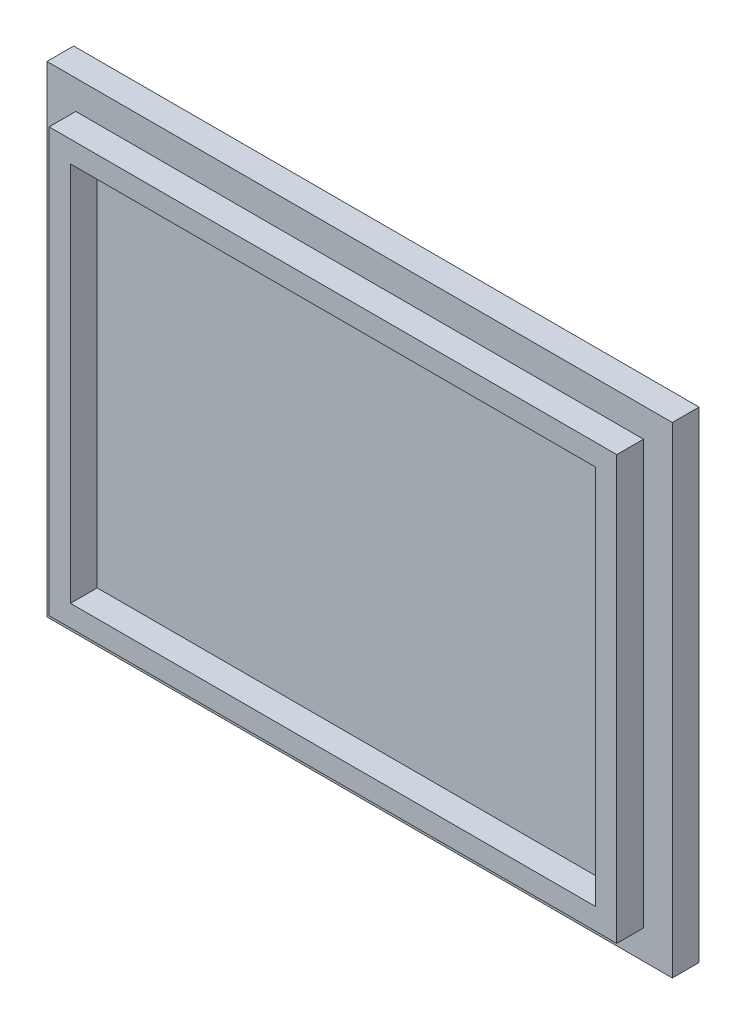
ISO-10303-21;
HEADER;
FILE_DESCRIPTION(('STEP AP214'),'2;1');
FILE_NAME('part.step','',(''),(''),'','','');
FILE_SCHEMA(('AUTOMOTIVE_DESIGN { 1 0 10303 214 1 1 1 1 }'));
ENDSEC;
DATA;
#1=APPLICATION_CONTEXT('core data for automotive mechanical design processes');
#2=APPLICATION_PROTOCOL_DEFINITION('international standard','automotive_design',2000,#1);
#3=PRODUCT_CONTEXT('',#1,'mechanical');
#4=PRODUCT('Part','Part','',(#3));
#5=PRODUCT_RELATED_PRODUCT_CATEGORY('part','',(#4));
#6=PRODUCT_DEFINITION_FORMATION('','',#4);
#7=PRODUCT_DEFINITION_CONTEXT('part definition',#1,'design');
#8=PRODUCT_DEFINITION('design','',#6,#7);
#9=PRODUCT_DEFINITION_SHAPE('','',#8);
#10=(LENGTH_UNIT() NAMED_UNIT(*) SI_UNIT(.MILLI.,.METRE.));
#11=(NAMED_UNIT(*) PLANE_ANGLE_UNIT() SI_UNIT($,.RADIAN.));
#12=(NAMED_UNIT(*) SI_UNIT($,.STERADIAN.) SOLID_ANGLE_UNIT());
#13=UNCERTAINTY_MEASURE_WITH_UNIT(LENGTH_MEASURE(1.E-05),#10,'distance_accuracy_value','');
#14=(GEOMETRIC_REPRESENTATION_CONTEXT(3) GLOBAL_UNCERTAINTY_ASSIGNED_CONTEXT((#13)) GLOBAL_UNIT_ASSIGNED_CONTEXT((#10,
#11,#12)) REPRESENTATION_CONTEXT('',''));
#15=CARTESIAN_POINT('',(0.,0.,0.));
#16=DIRECTION('',(0.,0.,1.));
#17=DIRECTION('',(1.,0.,0.));
#18=AXIS2_PLACEMENT_3D('',#15,#16,#17);
#19=CARTESIAN_POINT('',(0.,0.,6.35));
#20=DIRECTION('',(0.,0.,-1.));
#21=DIRECTION('',(-1.,0.,0.));
#22=AXIS2_PLACEMENT_3D('',#19,#20,#21);
#23=PLANE('',#22);
#24=DIRECTION('',(0.,1.,0.));
#25=VECTOR('',#24,1.);
#26=CARTESIAN_POINT('',(-67.437,-50.292,6.35));
#27=LINE('',#26,#25);
#28=CARTESIAN_POINT('',(-67.437,-50.292,6.35));
#29=VERTEX_POINT('',#28);
#30=CARTESIAN_POINT('',(-67.437,50.292,6.35));
#31=VERTEX_POINT('',#30);
#32=EDGE_CURVE('E72',#29,#31,#27,.T.);
#33=ORIENTED_EDGE('',*,*,#32,.T.);
#34=DIRECTION('',(1.,0.,0.));
#35=VECTOR('',#34,1.);
#36=CARTESIAN_POINT('',(-67.437,50.292,6.35));
#37=LINE('',#36,#35);
#38=CARTESIAN_POINT('',(67.437,50.292,6.35));
#39=VERTEX_POINT('',#38);
#40=EDGE_CURVE('E165',#31,#39,#37,.T.);
#41=ORIENTED_EDGE('',*,*,#40,.T.);
#42=DIRECTION('',(0.,1.,0.));
#43=VECTOR('',#42,1.);
#44=CARTESIAN_POINT('',(67.437,-50.292,6.35));
#45=LINE('',#44,#43);
#46=CARTESIAN_POINT('',(67.437,-50.292,6.35));
#47=VERTEX_POINT('',#46);
#48=EDGE_CURVE('E201',#47,#39,#45,.T.);
#49=ORIENTED_EDGE('',*,*,#48,.F.);
#50=DIRECTION('',(1.,0.,0.));
#51=VECTOR('',#50,1.);
#52=CARTESIAN_POINT('',(-67.437,-50.292,6.35));
#53=LINE('',#52,#51);
#54=EDGE_CURVE('E77',#29,#47,#53,.T.);
#55=ORIENTED_EDGE('',*,*,#54,.F.);
#56=EDGE_LOOP('',(#33,#41,#49,#55));
#57=FACE_BOUND('',#56,.T.);
#58=DIRECTION('',(0.,1.,0.));
#59=VECTOR('',#58,1.);
#60=CARTESIAN_POINT('',(74.295,-57.15,6.35));
#61=LINE('',#60,#59);
#62=CARTESIAN_POINT('',(74.295,-57.15,6.35));
#63=VERTEX_POINT('',#62);
#64=CARTESIAN_POINT('',(74.295,57.15,6.35));
#65=VERTEX_POINT('',#64);
#66=EDGE_CURVE('E216',#63,#65,#61,.T.);
#67=ORIENTED_EDGE('',*,*,#66,.T.);
#68=DIRECTION('',(-1.,0.,0.));
#69=VECTOR('',#68,1.);
#70=CARTESIAN_POINT('',(-74.295,57.15,6.35));
#71=LINE('',#70,#69);
#72=CARTESIAN_POINT('',(-74.295,57.15,6.35));
#73=VERTEX_POINT('',#72);
#74=EDGE_CURVE('E219',#65,#73,#71,.T.);
#75=ORIENTED_EDGE('',*,*,#74,.T.);
#76=DIRECTION('',(0.,-1.,0.));
#77=VECTOR('',#76,1.);
#78=CARTESIAN_POINT('',(-74.295,-57.15,6.35));
#79=LINE('',#78,#77);
#80=CARTESIAN_POINT('',(-74.295,-57.15,6.35));
#81=VERTEX_POINT('',#80);
#82=EDGE_CURVE('E222',#73,#81,#79,.T.);
#83=ORIENTED_EDGE('',*,*,#82,.T.);
#84=DIRECTION('',(1.,0.,0.));
#85=VECTOR('',#84,1.);
#86=CARTESIAN_POINT('',(-74.295,-57.15,6.35));
#87=LINE('',#86,#85);
#88=EDGE_CURVE('E224',#81,#63,#87,.T.);
#89=ORIENTED_EDGE('',*,*,#88,.T.);
#90=EDGE_LOOP('',(#67,#75,#83,#89));
#91=FACE_BOUND('',#90,.T.);
#92=ADVANCED_FACE('F57',(#57,#91),#23,.F.);
#93=CARTESIAN_POINT('',(74.295,-57.15,6.35));
#94=DIRECTION('',(-1.,0.,0.));
#95=DIRECTION('',(0.,0.,1.));
#96=AXIS2_PLACEMENT_3D('',#93,#94,#95);
#97=PLANE('',#96);
#98=DIRECTION('',(0.,1.,0.));
#99=VECTOR('',#98,1.);
#100=CARTESIAN_POINT('',(74.295,-57.15,0.));
#101=LINE('',#100,#99);
#102=CARTESIAN_POINT('',(74.295,-57.15,0.));
#103=VERTEX_POINT('',#102);
#104=CARTESIAN_POINT('',(74.295,57.15,0.));
#105=VERTEX_POINT('',#104);
#106=EDGE_CURVE('E208',#103,#105,#101,.T.);
#107=ORIENTED_EDGE('',*,*,#106,.T.);
#108=DIRECTION('',(0.,0.,-1.));
#109=VECTOR('',#108,1.);
#110=CARTESIAN_POINT('',(74.295,57.15,6.35));
#111=LINE('',#110,#109);
#112=EDGE_CURVE('E12',#65,#105,#111,.T.);
#113=ORIENTED_EDGE('',*,*,#112,.F.);
#114=ORIENTED_EDGE('',*,*,#66,.F.);
#115=DIRECTION('',(0.,0.,-1.));
#116=VECTOR('',#115,1.);
#117=CARTESIAN_POINT('',(74.295,-57.15,6.35));
#118=LINE('',#117,#116);
#119=EDGE_CURVE('E226',#63,#103,#118,.T.);
#120=ORIENTED_EDGE('',*,*,#119,.T.);
#121=EDGE_LOOP('',(#107,#113,#114,#120));
#122=FACE_BOUND('',#121,.T.);
#123=ADVANCED_FACE('F59',(#122),#97,.F.);
#124=CARTESIAN_POINT('',(-74.295,57.15,6.35));
#125=DIRECTION('',(0.,-1.,0.));
#126=DIRECTION('',(0.,0.,-1.));
#127=AXIS2_PLACEMENT_3D('',#124,#125,#126);
#128=PLANE('',#127);
#129=DIRECTION('',(-1.,0.,0.));
#130=VECTOR('',#129,1.);
#131=CARTESIAN_POINT('',(-74.295,57.15,0.));
#132=LINE('',#131,#130);
#133=CARTESIAN_POINT('',(-74.295,57.15,0.));
#134=VERTEX_POINT('',#133);
#135=EDGE_CURVE('E229',#105,#134,#132,.T.);
#136=ORIENTED_EDGE('',*,*,#135,.T.);
#137=DIRECTION('',(0.,0.,-1.));
#138=VECTOR('',#137,1.);
#139=CARTESIAN_POINT('',(-74.295,57.15,6.35));
#140=LINE('',#139,#138);
#141=EDGE_CURVE('E65',#73,#134,#140,.T.);
#142=ORIENTED_EDGE('',*,*,#141,.F.);
#143=ORIENTED_EDGE('',*,*,#74,.F.);
#144=ORIENTED_EDGE('',*,*,#112,.T.);
#145=EDGE_LOOP('',(#136,#142,#143,#144));
#146=FACE_BOUND('',#145,.T.);
#147=ADVANCED_FACE('F258',(#146),#128,.F.);
#148=CARTESIAN_POINT('',(-74.295,-57.15,6.35));
#149=DIRECTION('',(1.,0.,0.));
#150=DIRECTION('',(0.,0.,-1.));
#151=AXIS2_PLACEMENT_3D('',#148,#149,#150);
#152=PLANE('',#151);
#153=DIRECTION('',(0.,-1.,0.));
#154=VECTOR('',#153,1.);
#155=CARTESIAN_POINT('',(-74.295,-57.15,0.));
#156=LINE('',#155,#154);
#157=CARTESIAN_POINT('',(-74.295,-57.15,0.));
#158=VERTEX_POINT('',#157);
#159=EDGE_CURVE('E231',#134,#158,#156,.T.);
#160=ORIENTED_EDGE('',*,*,#159,.T.);
#161=DIRECTION('',(0.,0.,-1.));
#162=VECTOR('',#161,1.);
#163=CARTESIAN_POINT('',(-74.295,-57.15,6.35));
#164=LINE('',#163,#162);
#165=EDGE_CURVE('E236',#81,#158,#164,.T.);
#166=ORIENTED_EDGE('',*,*,#165,.F.);
#167=ORIENTED_EDGE('',*,*,#82,.F.);
#168=ORIENTED_EDGE('',*,*,#141,.T.);
#169=EDGE_LOOP('',(#160,#166,#167,#168));
#170=FACE_BOUND('',#169,.T.);
#171=ADVANCED_FACE('F243',(#170),#152,.F.);
#172=CARTESIAN_POINT('',(-74.295,-57.15,6.35));
#173=DIRECTION('',(0.,1.,0.));
#174=DIRECTION('',(0.,0.,1.));
#175=AXIS2_PLACEMENT_3D('',#172,#173,#174);
#176=PLANE('',#175);
#177=DIRECTION('',(1.,0.,0.));
#178=VECTOR('',#177,1.);
#179=CARTESIAN_POINT('',(-74.295,-57.15,0.));
#180=LINE('',#179,#178);
#181=EDGE_CURVE('E220',#158,#103,#180,.T.);
#182=ORIENTED_EDGE('',*,*,#181,.T.);
#183=ORIENTED_EDGE('',*,*,#119,.F.);
#184=ORIENTED_EDGE('',*,*,#88,.F.);
#185=ORIENTED_EDGE('',*,*,#165,.T.);
#186=EDGE_LOOP('',(#182,#183,#184,#185));
#187=FACE_BOUND('',#186,.T.);
#188=ADVANCED_FACE('F252',(#187),#176,.F.);
#189=CARTESIAN_POINT('',(0.,0.,0.));
#190=DIRECTION('',(0.,0.,-1.));
#191=DIRECTION('',(-1.,0.,0.));
#192=AXIS2_PLACEMENT_3D('',#189,#190,#191);
#193=PLANE('',#192);
#194=ORIENTED_EDGE('',*,*,#106,.F.);
#195=ORIENTED_EDGE('',*,*,#181,.F.);
#196=ORIENTED_EDGE('',*,*,#159,.F.);
#197=ORIENTED_EDGE('',*,*,#135,.F.);
#198=EDGE_LOOP('',(#194,#195,#196,#197));
#199=FACE_BOUND('',#198,.T.);
#200=ADVANCED_FACE('F249',(#199),#193,.T.);
#201=CARTESIAN_POINT('',(0.,0.,12.7));
#202=DIRECTION('',(0.,0.,1.));
#203=DIRECTION('',(1.,0.,0.));
#204=AXIS2_PLACEMENT_3D('',#201,#202,#203);
#205=PLANE('',#204);
#206=DIRECTION('',(1.,0.,0.));
#207=VECTOR('',#206,1.);
#208=CARTESIAN_POINT('',(-67.437,50.292,12.7));
#209=LINE('',#208,#207);
#210=CARTESIAN_POINT('',(-67.437,50.292,12.7));
#211=VERTEX_POINT('',#210);
#212=CARTESIAN_POINT('',(67.437,50.292,12.7));
#213=VERTEX_POINT('',#212);
#214=EDGE_CURVE('E189',#211,#213,#209,.T.);
#215=ORIENTED_EDGE('',*,*,#214,.F.);
#216=DIRECTION('',(0.,1.,0.));
#217=VECTOR('',#216,1.);
#218=CARTESIAN_POINT('',(-67.437,-50.292,12.7));
#219=LINE('',#218,#217);
#220=CARTESIAN_POINT('',(-67.437,-50.292,12.7));
#221=VERTEX_POINT('',#220);
#222=EDGE_CURVE('E196',#221,#211,#219,.T.);
#223=ORIENTED_EDGE('',*,*,#222,.F.);
#224=DIRECTION('',(1.,0.,0.));
#225=VECTOR('',#224,1.);
#226=CARTESIAN_POINT('',(-67.437,-50.292,12.7));
#227=LINE('',#226,#225);
#228=CARTESIAN_POINT('',(67.437,-50.292,12.7));
#229=VERTEX_POINT('',#228);
#230=EDGE_CURVE('E194',#221,#229,#227,.T.);
#231=ORIENTED_EDGE('',*,*,#230,.T.);
#232=DIRECTION('',(0.,1.,0.));
#233=VECTOR('',#232,1.);
#234=CARTESIAN_POINT('',(67.437,-50.292,12.7));
#235=LINE('',#234,#233);
#236=EDGE_CURVE('E192',#229,#213,#235,.T.);
#237=ORIENTED_EDGE('',*,*,#236,.T.);
#238=EDGE_LOOP('',(#215,#223,#231,#237));
#239=FACE_BOUND('',#238,.T.);
#240=DIRECTION('',(0.,1.,0.));
#241=VECTOR('',#240,1.);
#242=CARTESIAN_POINT('',(62.357,-45.212,12.7));
#243=LINE('',#242,#241);
#244=CARTESIAN_POINT('',(62.357,-45.212,12.7));
#245=VERTEX_POINT('',#244);
#246=CARTESIAN_POINT('',(62.357,45.212,12.7));
#247=VERTEX_POINT('',#246);
#248=EDGE_CURVE('E156',#245,#247,#243,.T.);
#249=ORIENTED_EDGE('',*,*,#248,.F.);
#250=DIRECTION('',(1.,0.,0.));
#251=VECTOR('',#250,1.);
#252=CARTESIAN_POINT('',(-62.357,-45.212,12.7));
#253=LINE('',#252,#251);
#254=CARTESIAN_POINT('',(-62.357,-45.212,12.7));
#255=VERTEX_POINT('',#254);
#256=EDGE_CURVE('E145',#255,#245,#253,.T.);
#257=ORIENTED_EDGE('',*,*,#256,.F.);
#258=DIRECTION('',(0.,1.,0.));
#259=VECTOR('',#258,1.);
#260=CARTESIAN_POINT('',(-62.357,-45.212,12.7));
#261=LINE('',#260,#259);
#262=CARTESIAN_POINT('',(-62.357,45.212,12.7));
#263=VERTEX_POINT('',#262);
#264=EDGE_CURVE('E172',#255,#263,#261,.T.);
#265=ORIENTED_EDGE('',*,*,#264,.T.);
#266=DIRECTION('',(1.,0.,0.));
#267=VECTOR('',#266,1.);
#268=CARTESIAN_POINT('',(-62.357,45.212,12.7));
#269=LINE('',#268,#267);
#270=EDGE_CURVE('E170',#263,#247,#269,.T.);
#271=ORIENTED_EDGE('',*,*,#270,.T.);
#272=EDGE_LOOP('',(#249,#257,#265,#271));
#273=FACE_BOUND('',#272,.T.);
#274=ADVANCED_FACE('F169',(#239,#273),#205,.T.);
#275=CARTESIAN_POINT('',(-67.437,50.292,12.7));
#276=DIRECTION('',(0.,1.,0.));
#277=DIRECTION('',(0.,0.,1.));
#278=AXIS2_PLACEMENT_3D('',#275,#276,#277);
#279=PLANE('',#278);
#280=ORIENTED_EDGE('',*,*,#40,.F.);
#281=DIRECTION('',(0.,0.,-1.));
#282=VECTOR('',#281,1.);
#283=CARTESIAN_POINT('',(-67.437,50.292,12.7));
#284=LINE('',#283,#282);
#285=EDGE_CURVE('E206',#211,#31,#284,.T.);
#286=ORIENTED_EDGE('',*,*,#285,.F.);
#287=ORIENTED_EDGE('',*,*,#214,.T.);
#288=DIRECTION('',(0.,0.,-1.));
#289=VECTOR('',#288,1.);
#290=CARTESIAN_POINT('',(67.437,50.292,12.7));
#291=LINE('',#290,#289);
#292=EDGE_CURVE('E199',#213,#39,#291,.T.);
#293=ORIENTED_EDGE('',*,*,#292,.T.);
#294=EDGE_LOOP('',(#280,#286,#287,#293));
#295=FACE_BOUND('',#294,.T.);
#296=ADVANCED_FACE('F295',(#295),#279,.T.);
#297=CARTESIAN_POINT('',(-67.437,-50.292,12.7));
#298=DIRECTION('',(-1.,0.,0.));
#299=DIRECTION('',(0.,0.,1.));
#300=AXIS2_PLACEMENT_3D('',#297,#298,#299);
#301=PLANE('',#300);
#302=ORIENTED_EDGE('',*,*,#32,.F.);
#303=DIRECTION('',(0.,0.,-1.));
#304=VECTOR('',#303,1.);
#305=CARTESIAN_POINT('',(-67.437,-50.292,12.7));
#306=LINE('',#305,#304);
#307=EDGE_CURVE('E209',#221,#29,#306,.T.);
#308=ORIENTED_EDGE('',*,*,#307,.F.);
#309=ORIENTED_EDGE('',*,*,#222,.T.);
#310=ORIENTED_EDGE('',*,*,#285,.T.);
#311=EDGE_LOOP('',(#302,#308,#309,#310));
#312=FACE_BOUND('',#311,.T.);
#313=ADVANCED_FACE('F297',(#312),#301,.T.);
#314=CARTESIAN_POINT('',(-67.437,-50.292,12.7));
#315=DIRECTION('',(0.,1.,0.));
#316=DIRECTION('',(0.,0.,1.));
#317=AXIS2_PLACEMENT_3D('',#314,#315,#316);
#318=PLANE('',#317);
#319=ORIENTED_EDGE('',*,*,#54,.T.);
#320=DIRECTION('',(0.,0.,-1.));
#321=VECTOR('',#320,1.);
#322=CARTESIAN_POINT('',(67.437,-50.292,12.7));
#323=LINE('',#322,#321);
#324=EDGE_CURVE('E211',#229,#47,#323,.T.);
#325=ORIENTED_EDGE('',*,*,#324,.F.);
#326=ORIENTED_EDGE('',*,*,#230,.F.);
#327=ORIENTED_EDGE('',*,*,#307,.T.);
#328=EDGE_LOOP('',(#319,#325,#326,#327));
#329=FACE_BOUND('',#328,.T.);
#330=ADVANCED_FACE('F300',(#329),#318,.F.);
#331=CARTESIAN_POINT('',(67.437,-50.292,12.7));
#332=DIRECTION('',(-1.,0.,0.));
#333=DIRECTION('',(0.,0.,1.));
#334=AXIS2_PLACEMENT_3D('',#331,#332,#333);
#335=PLANE('',#334);
#336=ORIENTED_EDGE('',*,*,#48,.T.);
#337=ORIENTED_EDGE('',*,*,#292,.F.);
#338=ORIENTED_EDGE('',*,*,#236,.F.);
#339=ORIENTED_EDGE('',*,*,#324,.T.);
#340=EDGE_LOOP('',(#336,#337,#338,#339));
#341=FACE_BOUND('',#340,.T.);
#342=ADVANCED_FACE('F292',(#341),#335,.F.);
#343=CARTESIAN_POINT('',(-62.357,-45.212,12.7));
#344=DIRECTION('',(0.,1.,0.));
#345=DIRECTION('',(0.,0.,1.));
#346=AXIS2_PLACEMENT_3D('',#343,#344,#345);
#347=PLANE('',#346);
#348=DIRECTION('',(1.,0.,0.));
#349=VECTOR('',#348,1.);
#350=CARTESIAN_POINT('',(-62.357,-45.212,6.35));
#351=LINE('',#350,#349);
#352=CARTESIAN_POINT('',(-62.357,-45.212,6.35));
#353=VERTEX_POINT('',#352);
#354=CARTESIAN_POINT('',(62.357,-45.212,6.35));
#355=VERTEX_POINT('',#354);
#356=EDGE_CURVE('E176',#353,#355,#351,.T.);
#357=ORIENTED_EDGE('',*,*,#356,.F.);
#358=DIRECTION('',(0.,0.,-1.));
#359=VECTOR('',#358,1.);
#360=CARTESIAN_POINT('',(-62.357,-45.212,12.7));
#361=LINE('',#360,#359);
#362=EDGE_CURVE('E151',#255,#353,#361,.T.);
#363=ORIENTED_EDGE('',*,*,#362,.F.);
#364=ORIENTED_EDGE('',*,*,#256,.T.);
#365=DIRECTION('',(0.,0.,-1.));
#366=VECTOR('',#365,1.);
#367=CARTESIAN_POINT('',(62.357,-45.212,12.7));
#368=LINE('',#367,#366);
#369=EDGE_CURVE('E149',#245,#355,#368,.T.);
#370=ORIENTED_EDGE('',*,*,#369,.T.);
#371=EDGE_LOOP('',(#357,#363,#364,#370));
#372=FACE_BOUND('',#371,.T.);
#373=ADVANCED_FACE('F148',(#372),#347,.T.);
#374=CARTESIAN_POINT('',(62.357,-45.212,12.7));
#375=DIRECTION('',(-1.,0.,0.));
#376=DIRECTION('',(0.,-1.,0.));
#377=AXIS2_PLACEMENT_3D('',#374,#375,#376);
#378=PLANE('',#377);
#379=DIRECTION('',(0.,1.,0.));
#380=VECTOR('',#379,1.);
#381=CARTESIAN_POINT('',(62.357,-45.212,6.35));
#382=LINE('',#381,#380);
#383=CARTESIAN_POINT('',(62.357,45.212,6.35));
#384=VERTEX_POINT('',#383);
#385=EDGE_CURVE('E164',#355,#384,#382,.T.);
#386=ORIENTED_EDGE('',*,*,#385,.F.);
#387=ORIENTED_EDGE('',*,*,#369,.F.);
#388=ORIENTED_EDGE('',*,*,#248,.T.);
#389=DIRECTION('',(0.,0.,-1.));
#390=VECTOR('',#389,1.);
#391=CARTESIAN_POINT('',(62.357,45.212,12.7));
#392=LINE('',#391,#390);
#393=EDGE_CURVE('E166',#247,#384,#392,.T.);
#394=ORIENTED_EDGE('',*,*,#393,.T.);
#395=EDGE_LOOP('',(#386,#387,#388,#394));
#396=FACE_BOUND('',#395,.T.);
#397=ADVANCED_FACE('F161',(#396),#378,.T.);
#398=CARTESIAN_POINT('',(-62.357,45.212,12.7));
#399=DIRECTION('',(0.,1.,0.));
#400=DIRECTION('',(-1.,0.,0.));
#401=AXIS2_PLACEMENT_3D('',#398,#399,#400);
#402=PLANE('',#401);
#403=DIRECTION('',(1.,0.,0.));
#404=VECTOR('',#403,1.);
#405=CARTESIAN_POINT('',(-62.357,45.212,6.35));
#406=LINE('',#405,#404);
#407=CARTESIAN_POINT('',(-62.357,45.212,6.35));
#408=VERTEX_POINT('',#407);
#409=EDGE_CURVE('E179',#408,#384,#406,.T.);
#410=ORIENTED_EDGE('',*,*,#409,.T.);
#411=ORIENTED_EDGE('',*,*,#393,.F.);
#412=ORIENTED_EDGE('',*,*,#270,.F.);
#413=DIRECTION('',(0.,0.,-1.));
#414=VECTOR('',#413,1.);
#415=CARTESIAN_POINT('',(-62.357,45.212,12.7));
#416=LINE('',#415,#414);
#417=EDGE_CURVE('E185',#263,#408,#416,.T.);
#418=ORIENTED_EDGE('',*,*,#417,.T.);
#419=EDGE_LOOP('',(#410,#411,#412,#418));
#420=FACE_BOUND('',#419,.T.);
#421=ADVANCED_FACE('F278',(#420),#402,.F.);
#422=CARTESIAN_POINT('',(-62.357,-45.212,12.7));
#423=DIRECTION('',(-1.,0.,0.));
#424=DIRECTION('',(0.,0.,1.));
#425=AXIS2_PLACEMENT_3D('',#422,#423,#424);
#426=PLANE('',#425);
#427=DIRECTION('',(0.,1.,0.));
#428=VECTOR('',#427,1.);
#429=CARTESIAN_POINT('',(-62.357,-45.212,6.35));
#430=LINE('',#429,#428);
#431=EDGE_CURVE('E157',#353,#408,#430,.T.);
#432=ORIENTED_EDGE('',*,*,#431,.T.);
#433=ORIENTED_EDGE('',*,*,#417,.F.);
#434=ORIENTED_EDGE('',*,*,#264,.F.);
#435=ORIENTED_EDGE('',*,*,#362,.T.);
#436=EDGE_LOOP('',(#432,#433,#434,#435));
#437=FACE_BOUND('',#436,.T.);
#438=ADVANCED_FACE('F273',(#437),#426,.F.);
#439=ORIENTED_EDGE('',*,*,#431,.F.);
#440=ORIENTED_EDGE('',*,*,#356,.T.);
#441=ORIENTED_EDGE('',*,*,#385,.T.);
#442=ORIENTED_EDGE('',*,*,#409,.F.);
#443=EDGE_LOOP('',(#439,#440,#441,#442));
#444=FACE_BOUND('',#443,.T.);
#445=ADVANCED_FACE('F267',(#444),#23,.F.);
#446=CLOSED_SHELL('',(#92,#123,#147,#171,#188,#200,#274,#296,#313,#330,#342,#373,#397,#421,#438,#445));
#447=MANIFOLD_SOLID_BREP('B2',#446);
#448=ADVANCED_BREP_SHAPE_REPRESENTATION('',(#18,#447),#14);
#449=SHAPE_DEFINITION_REPRESENTATION(#9,#448);
ENDSEC;
END-ISO-10303-21;
